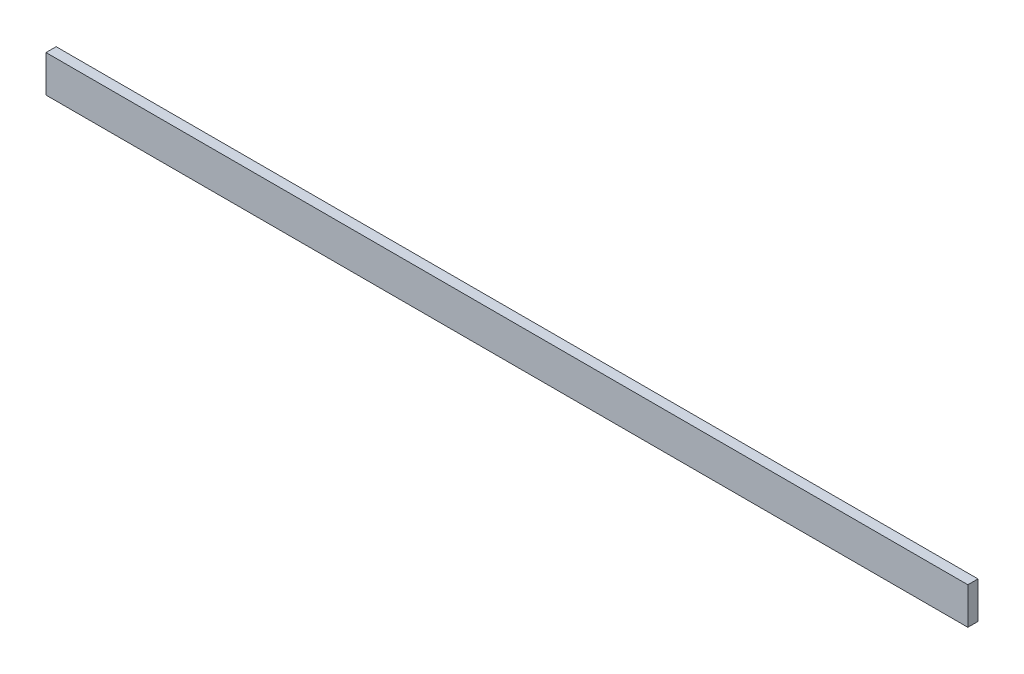
ISO-10303-21;
HEADER;
FILE_DESCRIPTION(('STEP AP214'),'2;1');
FILE_NAME('part.step','',(''),(''),'','','');
FILE_SCHEMA(('AUTOMOTIVE_DESIGN { 1 0 10303 214 1 1 1 1 }'));
ENDSEC;
DATA;
#1=APPLICATION_CONTEXT('core data for automotive mechanical design processes');
#2=APPLICATION_PROTOCOL_DEFINITION('international standard','automotive_design',2000,#1);
#3=PRODUCT_CONTEXT('',#1,'mechanical');
#4=PRODUCT('Part','Part','',(#3));
#5=PRODUCT_RELATED_PRODUCT_CATEGORY('part','',(#4));
#6=PRODUCT_DEFINITION_FORMATION('','',#4);
#7=PRODUCT_DEFINITION_CONTEXT('part definition',#1,'design');
#8=PRODUCT_DEFINITION('design','',#6,#7);
#9=PRODUCT_DEFINITION_SHAPE('','',#8);
#10=(LENGTH_UNIT() NAMED_UNIT(*) SI_UNIT(.MILLI.,.METRE.));
#11=(NAMED_UNIT(*) PLANE_ANGLE_UNIT() SI_UNIT($,.RADIAN.));
#12=(NAMED_UNIT(*) SI_UNIT($,.STERADIAN.) SOLID_ANGLE_UNIT());
#13=UNCERTAINTY_MEASURE_WITH_UNIT(LENGTH_MEASURE(1.E-05),#10,'distance_accuracy_value','');
#14=(GEOMETRIC_REPRESENTATION_CONTEXT(3) GLOBAL_UNCERTAINTY_ASSIGNED_CONTEXT((#13)) GLOBAL_UNIT_ASSIGNED_CONTEXT((#10,
#11,#12)) REPRESENTATION_CONTEXT('',''));
#15=CARTESIAN_POINT('',(0.,0.,0.));
#16=DIRECTION('',(0.,0.,1.));
#17=DIRECTION('',(1.,0.,0.));
#18=AXIS2_PLACEMENT_3D('',#15,#16,#17);
#19=CARTESIAN_POINT('',(0.,0.,22.));
#20=DIRECTION('',(1.,0.,0.));
#21=DIRECTION('',(0.,0.,-1.));
#22=AXIS2_PLACEMENT_3D('',#19,#20,#21);
#23=PLANE('',#22);
#24=DIRECTION('',(0.,-1.,0.));
#25=VECTOR('',#24,1.);
#26=CARTESIAN_POINT('',(0.,0.,0.));
#27=LINE('',#26,#25);
#28=CARTESIAN_POINT('',(0.,80.,0.));
#29=VERTEX_POINT('',#28);
#30=CARTESIAN_POINT('',(0.,0.,0.));
#31=VERTEX_POINT('',#30);
#32=EDGE_CURVE('E93',#29,#31,#27,.T.);
#33=ORIENTED_EDGE('',*,*,#32,.T.);
#34=DIRECTION('',(0.,0.,-1.));
#35=VECTOR('',#34,1.);
#36=CARTESIAN_POINT('',(0.,0.,22.));
#37=LINE('',#36,#35);
#38=CARTESIAN_POINT('',(0.,0.,22.));
#39=VERTEX_POINT('',#38);
#40=EDGE_CURVE('E11',#39,#31,#37,.T.);
#41=ORIENTED_EDGE('',*,*,#40,.F.);
#42=DIRECTION('',(0.,-1.,0.));
#43=VECTOR('',#42,1.);
#44=CARTESIAN_POINT('',(0.,0.,22.));
#45=LINE('',#44,#43);
#46=CARTESIAN_POINT('',(0.,80.,22.));
#47=VERTEX_POINT('',#46);
#48=EDGE_CURVE('E81',#47,#39,#45,.T.);
#49=ORIENTED_EDGE('',*,*,#48,.F.);
#50=DIRECTION('',(0.,0.,-1.));
#51=VECTOR('',#50,1.);
#52=CARTESIAN_POINT('',(0.,80.,22.));
#53=LINE('',#52,#51);
#54=EDGE_CURVE('E89',#47,#29,#53,.T.);
#55=ORIENTED_EDGE('',*,*,#54,.T.);
#56=EDGE_LOOP('',(#33,#41,#49,#55));
#57=FACE_BOUND('',#56,.T.);
#58=ADVANCED_FACE('F30',(#57),#23,.F.);
#59=CARTESIAN_POINT('',(0.,0.,22.));
#60=DIRECTION('',(0.,1.,0.));
#61=DIRECTION('',(0.,0.,1.));
#62=AXIS2_PLACEMENT_3D('',#59,#60,#61);
#63=PLANE('',#62);
#64=DIRECTION('',(1.,0.,0.));
#65=VECTOR('',#64,1.);
#66=CARTESIAN_POINT('',(0.,0.,0.));
#67=LINE('',#66,#65);
#68=CARTESIAN_POINT('',(2000.,0.,0.));
#69=VERTEX_POINT('',#68);
#70=EDGE_CURVE('E85',#31,#69,#67,.T.);
#71=ORIENTED_EDGE('',*,*,#70,.T.);
#72=DIRECTION('',(0.,0.,-1.));
#73=VECTOR('',#72,1.);
#74=CARTESIAN_POINT('',(2000.,0.,22.));
#75=LINE('',#74,#73);
#76=CARTESIAN_POINT('',(2000.,0.,22.));
#77=VERTEX_POINT('',#76);
#78=EDGE_CURVE('E38',#77,#69,#75,.T.);
#79=ORIENTED_EDGE('',*,*,#78,.F.);
#80=DIRECTION('',(1.,0.,0.));
#81=VECTOR('',#80,1.);
#82=CARTESIAN_POINT('',(0.,0.,22.));
#83=LINE('',#82,#81);
#84=EDGE_CURVE('E76',#39,#77,#83,.T.);
#85=ORIENTED_EDGE('',*,*,#84,.F.);
#86=ORIENTED_EDGE('',*,*,#40,.T.);
#87=EDGE_LOOP('',(#71,#79,#85,#86));
#88=FACE_BOUND('',#87,.T.);
#89=ADVANCED_FACE('F84',(#88),#63,.F.);
#90=CARTESIAN_POINT('',(2000.,0.,22.));
#91=DIRECTION('',(-1.,0.,0.));
#92=DIRECTION('',(0.,0.,1.));
#93=AXIS2_PLACEMENT_3D('',#90,#91,#92);
#94=PLANE('',#93);
#95=DIRECTION('',(0.,1.,0.));
#96=VECTOR('',#95,1.);
#97=CARTESIAN_POINT('',(2000.,0.,0.));
#98=LINE('',#97,#96);
#99=CARTESIAN_POINT('',(2000.,80.,0.));
#100=VERTEX_POINT('',#99);
#101=EDGE_CURVE('E63',#69,#100,#98,.T.);
#102=ORIENTED_EDGE('',*,*,#101,.T.);
#103=DIRECTION('',(0.,0.,-1.));
#104=VECTOR('',#103,1.);
#105=CARTESIAN_POINT('',(2000.,80.,22.));
#106=LINE('',#105,#104);
#107=CARTESIAN_POINT('',(2000.,80.,22.));
#108=VERTEX_POINT('',#107);
#109=EDGE_CURVE('E86',#108,#100,#106,.T.);
#110=ORIENTED_EDGE('',*,*,#109,.F.);
#111=DIRECTION('',(0.,1.,0.));
#112=VECTOR('',#111,1.);
#113=CARTESIAN_POINT('',(2000.,0.,22.));
#114=LINE('',#113,#112);
#115=EDGE_CURVE('E79',#77,#108,#114,.T.);
#116=ORIENTED_EDGE('',*,*,#115,.F.);
#117=ORIENTED_EDGE('',*,*,#78,.T.);
#118=EDGE_LOOP('',(#102,#110,#116,#117));
#119=FACE_BOUND('',#118,.T.);
#120=ADVANCED_FACE('F87',(#119),#94,.F.);
#121=CARTESIAN_POINT('',(0.,80.,22.));
#122=DIRECTION('',(0.,-1.,0.));
#123=DIRECTION('',(0.,0.,-1.));
#124=AXIS2_PLACEMENT_3D('',#121,#122,#123);
#125=PLANE('',#124);
#126=DIRECTION('',(-1.,0.,0.));
#127=VECTOR('',#126,1.);
#128=CARTESIAN_POINT('',(0.,80.,0.));
#129=LINE('',#128,#127);
#130=EDGE_CURVE('E69',#100,#29,#129,.T.);
#131=ORIENTED_EDGE('',*,*,#130,.T.);
#132=ORIENTED_EDGE('',*,*,#54,.F.);
#133=DIRECTION('',(-1.,0.,0.));
#134=VECTOR('',#133,1.);
#135=CARTESIAN_POINT('',(0.,80.,22.));
#136=LINE('',#135,#134);
#137=EDGE_CURVE('E46',#108,#47,#136,.T.);
#138=ORIENTED_EDGE('',*,*,#137,.F.);
#139=ORIENTED_EDGE('',*,*,#109,.T.);
#140=EDGE_LOOP('',(#131,#132,#138,#139));
#141=FACE_BOUND('',#140,.T.);
#142=ADVANCED_FACE('F100',(#141),#125,.F.);
#143=CARTESIAN_POINT('',(0.,80.,22.));
#144=DIRECTION('',(0.,0.,-1.));
#145=DIRECTION('',(-1.,0.,0.));
#146=AXIS2_PLACEMENT_3D('',#143,#144,#145);
#147=PLANE('',#146);
#148=ORIENTED_EDGE('',*,*,#48,.T.);
#149=ORIENTED_EDGE('',*,*,#84,.T.);
#150=ORIENTED_EDGE('',*,*,#115,.T.);
#151=ORIENTED_EDGE('',*,*,#137,.T.);
#152=EDGE_LOOP('',(#148,#149,#150,#151));
#153=FACE_BOUND('',#152,.T.);
#154=ADVANCED_FACE('F77',(#153),#147,.F.);
#155=CARTESIAN_POINT('',(0.,80.,0.));
#156=DIRECTION('',(0.,0.,-1.));
#157=DIRECTION('',(-1.,0.,0.));
#158=AXIS2_PLACEMENT_3D('',#155,#156,#157);
#159=PLANE('',#158);
#160=ORIENTED_EDGE('',*,*,#32,.F.);
#161=ORIENTED_EDGE('',*,*,#130,.F.);
#162=ORIENTED_EDGE('',*,*,#101,.F.);
#163=ORIENTED_EDGE('',*,*,#70,.F.);
#164=EDGE_LOOP('',(#160,#161,#162,#163));
#165=FACE_BOUND('',#164,.T.);
#166=ADVANCED_FACE('F103',(#165),#159,.T.);
#167=CLOSED_SHELL('',(#58,#89,#120,#142,#154,#166));
#168=MANIFOLD_SOLID_BREP('B2',#167);
#169=ADVANCED_BREP_SHAPE_REPRESENTATION('',(#18,#168),#14);
#170=SHAPE_DEFINITION_REPRESENTATION(#9,#169);
ENDSEC;
END-ISO-10303-21;
